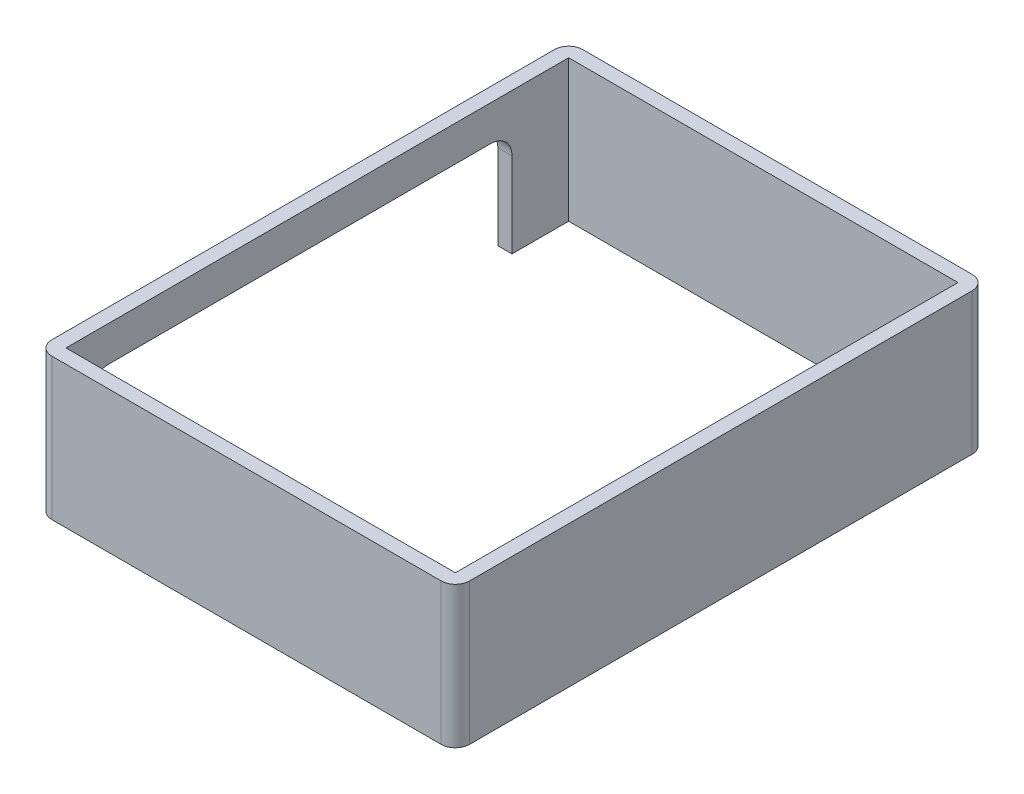
ISO-10303-21;
HEADER;
FILE_DESCRIPTION(('STEP AP214'),'2;1');
FILE_NAME('part.step','',(''),(''),'','','');
FILE_SCHEMA(('AUTOMOTIVE_DESIGN { 1 0 10303 214 1 1 1 1 }'));
ENDSEC;
DATA;
#1=APPLICATION_CONTEXT('core data for automotive mechanical design processes');
#2=APPLICATION_PROTOCOL_DEFINITION('international standard','automotive_design',2000,#1);
#3=PRODUCT_CONTEXT('',#1,'mechanical');
#4=PRODUCT('Part','Part','',(#3));
#5=PRODUCT_RELATED_PRODUCT_CATEGORY('part','',(#4));
#6=PRODUCT_DEFINITION_FORMATION('','',#4);
#7=PRODUCT_DEFINITION_CONTEXT('part definition',#1,'design');
#8=PRODUCT_DEFINITION('design','',#6,#7);
#9=PRODUCT_DEFINITION_SHAPE('','',#8);
#10=(LENGTH_UNIT() NAMED_UNIT(*) SI_UNIT(.MILLI.,.METRE.));
#11=(NAMED_UNIT(*) PLANE_ANGLE_UNIT() SI_UNIT($,.RADIAN.));
#12=(NAMED_UNIT(*) SI_UNIT($,.STERADIAN.) SOLID_ANGLE_UNIT());
#13=UNCERTAINTY_MEASURE_WITH_UNIT(LENGTH_MEASURE(1.E-05),#10,'distance_accuracy_value','');
#14=(GEOMETRIC_REPRESENTATION_CONTEXT(3) GLOBAL_UNCERTAINTY_ASSIGNED_CONTEXT((#13)) GLOBAL_UNIT_ASSIGNED_CONTEXT((#10,
#11,#12)) REPRESENTATION_CONTEXT('',''));
#15=CARTESIAN_POINT('',(0.,0.,0.));
#16=DIRECTION('',(0.,0.,1.));
#17=DIRECTION('',(1.,0.,0.));
#18=AXIS2_PLACEMENT_3D('',#15,#16,#17);
#19=CARTESIAN_POINT('',(27.5,20.,35.5));
#20=DIRECTION('',(0.,1.,0.));
#21=DIRECTION('',(0.,0.,1.));
#22=AXIS2_PLACEMENT_3D('',#19,#20,#21);
#23=PLANE('',#22);
#24=CARTESIAN_POINT('',(27.5,20.,35.5));
#25=DIRECTION('',(0.,1.,0.));
#26=DIRECTION('',(0.,0.,1.));
#27=AXIS2_PLACEMENT_3D('',#24,#25,#26);
#28=CIRCLE('',#27,2.);
#29=CARTESIAN_POINT('',(27.5,20.,37.5));
#30=VERTEX_POINT('',#29);
#31=CARTESIAN_POINT('',(29.5,20.,35.5));
#32=VERTEX_POINT('',#31);
#33=EDGE_CURVE('E256',#30,#32,#28,.T.);
#34=ORIENTED_EDGE('',*,*,#33,.T.);
#35=DIRECTION('',(0.,0.,-1.));
#36=VECTOR('',#35,1.);
#37=CARTESIAN_POINT('',(29.5,20.,35.5));
#38=LINE('',#37,#36);
#39=CARTESIAN_POINT('',(29.5,20.,-35.5));
#40=VERTEX_POINT('',#39);
#41=EDGE_CURVE('E260',#32,#40,#38,.T.);
#42=ORIENTED_EDGE('',*,*,#41,.T.);
#43=CARTESIAN_POINT('',(27.5,20.,-35.5));
#44=DIRECTION('',(0.,1.,0.));
#45=DIRECTION('',(0.,0.,1.));
#46=AXIS2_PLACEMENT_3D('',#43,#44,#45);
#47=CIRCLE('',#46,2.);
#48=CARTESIAN_POINT('',(27.5,20.,-37.5));
#49=VERTEX_POINT('',#48);
#50=EDGE_CURVE('E264',#40,#49,#47,.T.);
#51=ORIENTED_EDGE('',*,*,#50,.T.);
#52=DIRECTION('',(-1.,0.,0.));
#53=VECTOR('',#52,1.);
#54=CARTESIAN_POINT('',(27.5,20.,-37.5));
#55=LINE('',#54,#53);
#56=CARTESIAN_POINT('',(-27.5,20.,-37.5));
#57=VERTEX_POINT('',#56);
#58=EDGE_CURVE('E267',#49,#57,#55,.T.);
#59=ORIENTED_EDGE('',*,*,#58,.T.);
#60=CARTESIAN_POINT('',(-27.5,20.,-35.5));
#61=DIRECTION('',(0.,1.,0.));
#62=DIRECTION('',(0.,0.,1.));
#63=AXIS2_PLACEMENT_3D('',#60,#61,#62);
#64=CIRCLE('',#63,2.);
#65=CARTESIAN_POINT('',(-29.5,20.,-35.5));
#66=VERTEX_POINT('',#65);
#67=EDGE_CURVE('E270',#57,#66,#64,.T.);
#68=ORIENTED_EDGE('',*,*,#67,.T.);
#69=DIRECTION('',(0.,0.,1.));
#70=VECTOR('',#69,1.);
#71=CARTESIAN_POINT('',(-29.5,20.,-35.5));
#72=LINE('',#71,#70);
#73=CARTESIAN_POINT('',(-29.5,20.,35.5));
#74=VERTEX_POINT('',#73);
#75=EDGE_CURVE('E273',#66,#74,#72,.T.);
#76=ORIENTED_EDGE('',*,*,#75,.T.);
#77=CARTESIAN_POINT('',(-27.5,20.,35.5));
#78=DIRECTION('',(0.,1.,0.));
#79=DIRECTION('',(0.,0.,1.));
#80=AXIS2_PLACEMENT_3D('',#77,#78,#79);
#81=CIRCLE('',#80,2.);
#82=CARTESIAN_POINT('',(-27.5,20.,37.5));
#83=VERTEX_POINT('',#82);
#84=EDGE_CURVE('E276',#74,#83,#81,.T.);
#85=ORIENTED_EDGE('',*,*,#84,.T.);
#86=DIRECTION('',(1.,0.,0.));
#87=VECTOR('',#86,1.);
#88=CARTESIAN_POINT('',(-27.5,20.,37.5));
#89=LINE('',#88,#87);
#90=EDGE_CURVE('E279',#83,#30,#89,.T.);
#91=ORIENTED_EDGE('',*,*,#90,.T.);
#92=EDGE_LOOP('',(#34,#42,#51,#59,#68,#76,#85,#91));
#93=FACE_BOUND('',#92,.T.);
#94=DIRECTION('',(0.,0.,-1.));
#95=VECTOR('',#94,1.);
#96=CARTESIAN_POINT('',(27.5,20.,35.5));
#97=LINE('',#96,#95);
#98=CARTESIAN_POINT('',(27.5,20.,35.5));
#99=VERTEX_POINT('',#98);
#100=CARTESIAN_POINT('',(27.5,20.,-35.5));
#101=VERTEX_POINT('',#100);
#102=EDGE_CURVE('E217',#99,#101,#97,.T.);
#103=ORIENTED_EDGE('',*,*,#102,.F.);
#104=DIRECTION('',(1.,0.,0.));
#105=VECTOR('',#104,1.);
#106=CARTESIAN_POINT('',(-27.5,20.,35.5));
#107=LINE('',#106,#105);
#108=CARTESIAN_POINT('',(-27.5,20.,35.5));
#109=VERTEX_POINT('',#108);
#110=EDGE_CURVE('E214',#109,#99,#107,.T.);
#111=ORIENTED_EDGE('',*,*,#110,.F.);
#112=DIRECTION('',(0.,0.,1.));
#113=VECTOR('',#112,1.);
#114=CARTESIAN_POINT('',(-27.5,20.,-35.5));
#115=LINE('',#114,#113);
#116=CARTESIAN_POINT('',(-27.5,20.,-35.5));
#117=VERTEX_POINT('',#116);
#118=EDGE_CURVE('E224',#117,#109,#115,.T.);
#119=ORIENTED_EDGE('',*,*,#118,.F.);
#120=DIRECTION('',(-1.,0.,0.));
#121=VECTOR('',#120,1.);
#122=CARTESIAN_POINT('',(27.5,20.,-35.5));
#123=LINE('',#122,#121);
#124=EDGE_CURVE('E221',#101,#117,#123,.T.);
#125=ORIENTED_EDGE('',*,*,#124,.F.);
#126=EDGE_LOOP('',(#103,#111,#119,#125));
#127=FACE_BOUND('',#126,.T.);
#128=ADVANCED_FACE('F39',(#93,#127),#23,.T.);
#129=CARTESIAN_POINT('',(27.5,0.,35.5));
#130=DIRECTION('',(0.,1.,0.));
#131=DIRECTION('',(0.,0.,1.));
#132=AXIS2_PLACEMENT_3D('',#129,#130,#131);
#133=PLANE('',#132);
#134=DIRECTION('',(0.,0.,1.));
#135=VECTOR('',#134,1.);
#136=CARTESIAN_POINT('',(-29.5,0.,-35.5));
#137=LINE('',#136,#135);
#138=CARTESIAN_POINT('',(-29.5,0.,32.5));
#139=VERTEX_POINT('',#138);
#140=CARTESIAN_POINT('',(-29.5,0.,35.5));
#141=VERTEX_POINT('',#140);
#142=EDGE_CURVE('E298',#139,#141,#137,.T.);
#143=ORIENTED_EDGE('',*,*,#142,.F.);
#144=DIRECTION('',(1.,0.,0.));
#145=VECTOR('',#144,1.);
#146=CARTESIAN_POINT('',(27.5,0.,32.5));
#147=LINE('',#146,#145);
#148=CARTESIAN_POINT('',(-27.5,0.,32.5));
#149=VERTEX_POINT('',#148);
#150=EDGE_CURVE('E170',#139,#149,#147,.T.);
#151=ORIENTED_EDGE('',*,*,#150,.T.);
#152=DIRECTION('',(0.,0.,1.));
#153=VECTOR('',#152,1.);
#154=CARTESIAN_POINT('',(-27.5,0.,-35.5));
#155=LINE('',#154,#153);
#156=CARTESIAN_POINT('',(-27.5,0.,35.5));
#157=VERTEX_POINT('',#156);
#158=EDGE_CURVE('E239',#149,#157,#155,.T.);
#159=ORIENTED_EDGE('',*,*,#158,.T.);
#160=DIRECTION('',(1.,0.,0.));
#161=VECTOR('',#160,1.);
#162=CARTESIAN_POINT('',(-27.5,0.,35.5));
#163=LINE('',#162,#161);
#164=CARTESIAN_POINT('',(27.5,0.,35.5));
#165=VERTEX_POINT('',#164);
#166=EDGE_CURVE('E213',#157,#165,#163,.T.);
#167=ORIENTED_EDGE('',*,*,#166,.T.);
#168=DIRECTION('',(0.,0.,-1.));
#169=VECTOR('',#168,1.);
#170=CARTESIAN_POINT('',(27.5,0.,35.5));
#171=LINE('',#170,#169);
#172=CARTESIAN_POINT('',(27.5,0.,-35.5));
#173=VERTEX_POINT('',#172);
#174=EDGE_CURVE('E231',#165,#173,#171,.T.);
#175=ORIENTED_EDGE('',*,*,#174,.T.);
#176=DIRECTION('',(-1.,0.,0.));
#177=VECTOR('',#176,1.);
#178=CARTESIAN_POINT('',(27.5,0.,-35.5));
#179=LINE('',#178,#177);
#180=CARTESIAN_POINT('',(-27.5,0.,-35.5));
#181=VERTEX_POINT('',#180);
#182=EDGE_CURVE('E235',#173,#181,#179,.T.);
#183=ORIENTED_EDGE('',*,*,#182,.T.);
#184=CARTESIAN_POINT('',(-27.5,0.,-27.5));
#185=VERTEX_POINT('',#184);
#186=EDGE_CURVE('E218',#181,#185,#155,.T.);
#187=ORIENTED_EDGE('',*,*,#186,.T.);
#188=DIRECTION('',(-1.,0.,0.));
#189=VECTOR('',#188,1.);
#190=CARTESIAN_POINT('',(27.5,0.,-27.5));
#191=LINE('',#190,#189);
#192=CARTESIAN_POINT('',(-29.5,0.,-27.5));
#193=VERTEX_POINT('',#192);
#194=EDGE_CURVE('E202',#185,#193,#191,.T.);
#195=ORIENTED_EDGE('',*,*,#194,.T.);
#196=CARTESIAN_POINT('',(-29.5,0.,-35.5));
#197=VERTEX_POINT('',#196);
#198=EDGE_CURVE('E299',#197,#193,#137,.T.);
#199=ORIENTED_EDGE('',*,*,#198,.F.);
#200=CARTESIAN_POINT('',(-27.5,0.,-35.5));
#201=DIRECTION('',(0.,1.,0.));
#202=DIRECTION('',(0.,0.,1.));
#203=AXIS2_PLACEMENT_3D('',#200,#201,#202);
#204=CIRCLE('',#203,2.);
#205=CARTESIAN_POINT('',(-27.5,0.,-37.5));
#206=VERTEX_POINT('',#205);
#207=EDGE_CURVE('E295',#206,#197,#204,.T.);
#208=ORIENTED_EDGE('',*,*,#207,.F.);
#209=DIRECTION('',(-1.,0.,0.));
#210=VECTOR('',#209,1.);
#211=CARTESIAN_POINT('',(27.5,0.,-37.5));
#212=LINE('',#211,#210);
#213=CARTESIAN_POINT('',(27.5,0.,-37.5));
#214=VERTEX_POINT('',#213);
#215=EDGE_CURVE('E292',#214,#206,#212,.T.);
#216=ORIENTED_EDGE('',*,*,#215,.F.);
#217=CARTESIAN_POINT('',(27.5,0.,-35.5));
#218=DIRECTION('',(0.,1.,0.));
#219=DIRECTION('',(0.,0.,1.));
#220=AXIS2_PLACEMENT_3D('',#217,#218,#219);
#221=CIRCLE('',#220,2.);
#222=CARTESIAN_POINT('',(29.5,0.,-35.5));
#223=VERTEX_POINT('',#222);
#224=EDGE_CURVE('E289',#223,#214,#221,.T.);
#225=ORIENTED_EDGE('',*,*,#224,.F.);
#226=DIRECTION('',(0.,0.,-1.));
#227=VECTOR('',#226,1.);
#228=CARTESIAN_POINT('',(29.5,0.,35.5));
#229=LINE('',#228,#227);
#230=CARTESIAN_POINT('',(29.5,0.,35.5));
#231=VERTEX_POINT('',#230);
#232=EDGE_CURVE('E286',#231,#223,#229,.T.);
#233=ORIENTED_EDGE('',*,*,#232,.F.);
#234=CARTESIAN_POINT('',(27.5,0.,35.5));
#235=DIRECTION('',(0.,1.,0.));
#236=DIRECTION('',(0.,0.,1.));
#237=AXIS2_PLACEMENT_3D('',#234,#235,#236);
#238=CIRCLE('',#237,2.);
#239=CARTESIAN_POINT('',(27.5,0.,37.5));
#240=VERTEX_POINT('',#239);
#241=EDGE_CURVE('E255',#240,#231,#238,.T.);
#242=ORIENTED_EDGE('',*,*,#241,.F.);
#243=DIRECTION('',(1.,0.,0.));
#244=VECTOR('',#243,1.);
#245=CARTESIAN_POINT('',(-27.5,0.,37.5));
#246=LINE('',#245,#244);
#247=CARTESIAN_POINT('',(-27.5,0.,37.5));
#248=VERTEX_POINT('',#247);
#249=EDGE_CURVE('E261',#248,#240,#246,.T.);
#250=ORIENTED_EDGE('',*,*,#249,.F.);
#251=CARTESIAN_POINT('',(-27.5,0.,35.5));
#252=DIRECTION('',(0.,1.,0.));
#253=DIRECTION('',(0.,0.,1.));
#254=AXIS2_PLACEMENT_3D('',#251,#252,#253);
#255=CIRCLE('',#254,2.);
#256=EDGE_CURVE('E303',#141,#248,#255,.T.);
#257=ORIENTED_EDGE('',*,*,#256,.F.);
#258=EDGE_LOOP('',(#143,#151,#159,#167,#175,#183,#187,#195,#199,#208,#216,#225,#233,#242,#250,#257));
#259=FACE_BOUND('',#258,.T.);
#260=ADVANCED_FACE('F362',(#259),#133,.F.);
#261=CARTESIAN_POINT('',(27.5,20.,35.5));
#262=DIRECTION('',(0.,-1.,0.));
#263=DIRECTION('',(0.,0.,-1.));
#264=AXIS2_PLACEMENT_3D('',#261,#262,#263);
#265=CYLINDRICAL_SURFACE('',#264,2.);
#266=ORIENTED_EDGE('',*,*,#241,.T.);
#267=DIRECTION('',(0.,-1.,0.));
#268=VECTOR('',#267,1.);
#269=CARTESIAN_POINT('',(29.5,20.,35.5));
#270=LINE('',#269,#268);
#271=EDGE_CURVE('E335',#32,#231,#270,.T.);
#272=ORIENTED_EDGE('',*,*,#271,.F.);
#273=ORIENTED_EDGE('',*,*,#33,.F.);
#274=DIRECTION('',(0.,-1.,0.));
#275=VECTOR('',#274,1.);
#276=CARTESIAN_POINT('',(27.5,20.,37.5));
#277=LINE('',#276,#275);
#278=EDGE_CURVE('E282',#30,#240,#277,.T.);
#279=ORIENTED_EDGE('',*,*,#278,.T.);
#280=EDGE_LOOP('',(#266,#272,#273,#279));
#281=FACE_BOUND('',#280,.T.);
#282=ADVANCED_FACE('F41',(#281),#265,.T.);
#283=CARTESIAN_POINT('',(29.5,20.,35.5));
#284=DIRECTION('',(-1.,0.,0.));
#285=DIRECTION('',(0.,0.,1.));
#286=AXIS2_PLACEMENT_3D('',#283,#284,#285);
#287=PLANE('',#286);
#288=ORIENTED_EDGE('',*,*,#232,.T.);
#289=DIRECTION('',(0.,-1.,0.));
#290=VECTOR('',#289,1.);
#291=CARTESIAN_POINT('',(29.5,20.,-35.5));
#292=LINE('',#291,#290);
#293=EDGE_CURVE('E331',#40,#223,#292,.T.);
#294=ORIENTED_EDGE('',*,*,#293,.F.);
#295=ORIENTED_EDGE('',*,*,#41,.F.);
#296=ORIENTED_EDGE('',*,*,#271,.T.);
#297=EDGE_LOOP('',(#288,#294,#295,#296));
#298=FACE_BOUND('',#297,.T.);
#299=ADVANCED_FACE('F414',(#298),#287,.F.);
#300=CARTESIAN_POINT('',(27.5,20.,-35.5));
#301=DIRECTION('',(0.,-1.,0.));
#302=DIRECTION('',(0.,0.,-1.));
#303=AXIS2_PLACEMENT_3D('',#300,#301,#302);
#304=CYLINDRICAL_SURFACE('',#303,2.);
#305=ORIENTED_EDGE('',*,*,#224,.T.);
#306=DIRECTION('',(0.,-1.,0.));
#307=VECTOR('',#306,1.);
#308=CARTESIAN_POINT('',(27.5,20.,-37.5));
#309=LINE('',#308,#307);
#310=EDGE_CURVE('E327',#49,#214,#309,.T.);
#311=ORIENTED_EDGE('',*,*,#310,.F.);
#312=ORIENTED_EDGE('',*,*,#50,.F.);
#313=ORIENTED_EDGE('',*,*,#293,.T.);
#314=EDGE_LOOP('',(#305,#311,#312,#313));
#315=FACE_BOUND('',#314,.T.);
#316=ADVANCED_FACE('F412',(#315),#304,.T.);
#317=CARTESIAN_POINT('',(27.5,20.,-37.5));
#318=DIRECTION('',(0.,0.,1.));
#319=DIRECTION('',(1.,0.,0.));
#320=AXIS2_PLACEMENT_3D('',#317,#318,#319);
#321=PLANE('',#320);
#322=ORIENTED_EDGE('',*,*,#215,.T.);
#323=DIRECTION('',(0.,-1.,0.));
#324=VECTOR('',#323,1.);
#325=CARTESIAN_POINT('',(-27.5,20.,-37.5));
#326=LINE('',#325,#324);
#327=EDGE_CURVE('E323',#57,#206,#326,.T.);
#328=ORIENTED_EDGE('',*,*,#327,.F.);
#329=ORIENTED_EDGE('',*,*,#58,.F.);
#330=ORIENTED_EDGE('',*,*,#310,.T.);
#331=EDGE_LOOP('',(#322,#328,#329,#330));
#332=FACE_BOUND('',#331,.T.);
#333=ADVANCED_FACE('F407',(#332),#321,.F.);
#334=CARTESIAN_POINT('',(-27.5,20.,-35.5));
#335=DIRECTION('',(0.,-1.,0.));
#336=DIRECTION('',(0.,0.,-1.));
#337=AXIS2_PLACEMENT_3D('',#334,#335,#336);
#338=CYLINDRICAL_SURFACE('',#337,2.);
#339=ORIENTED_EDGE('',*,*,#207,.T.);
#340=DIRECTION('',(0.,-1.,0.));
#341=VECTOR('',#340,1.);
#342=CARTESIAN_POINT('',(-29.5,20.,-35.5));
#343=LINE('',#342,#341);
#344=EDGE_CURVE('E319',#66,#197,#343,.T.);
#345=ORIENTED_EDGE('',*,*,#344,.F.);
#346=ORIENTED_EDGE('',*,*,#67,.F.);
#347=ORIENTED_EDGE('',*,*,#327,.T.);
#348=EDGE_LOOP('',(#339,#345,#346,#347));
#349=FACE_BOUND('',#348,.T.);
#350=ADVANCED_FACE('F402',(#349),#338,.T.);
#351=CARTESIAN_POINT('',(-29.5,20.,-35.5));
#352=DIRECTION('',(1.,0.,0.));
#353=DIRECTION('',(0.,0.,-1.));
#354=AXIS2_PLACEMENT_3D('',#351,#352,#353);
#355=PLANE('',#354);
#356=CARTESIAN_POINT('',(-29.5,12.,29.5));
#357=DIRECTION('',(-1.,0.,0.));
#358=DIRECTION('',(0.,0.,-1.));
#359=AXIS2_PLACEMENT_3D('',#356,#357,#358);
#360=CIRCLE('',#359,3.);
#361=CARTESIAN_POINT('',(-29.5,12.,32.5));
#362=VERTEX_POINT('',#361);
#363=CARTESIAN_POINT('',(-29.5,15.,29.5));
#364=VERTEX_POINT('',#363);
#365=EDGE_CURVE('E175',#362,#364,#360,.T.);
#366=ORIENTED_EDGE('',*,*,#365,.F.);
#367=DIRECTION('',(0.,1.,0.));
#368=VECTOR('',#367,1.);
#369=CARTESIAN_POINT('',(-29.5,12.,32.5));
#370=LINE('',#369,#368);
#371=EDGE_CURVE('E164',#139,#362,#370,.T.);
#372=ORIENTED_EDGE('',*,*,#371,.F.);
#373=ORIENTED_EDGE('',*,*,#142,.T.);
#374=DIRECTION('',(0.,-1.,0.));
#375=VECTOR('',#374,1.);
#376=CARTESIAN_POINT('',(-29.5,20.,35.5));
#377=LINE('',#376,#375);
#378=EDGE_CURVE('E315',#74,#141,#377,.T.);
#379=ORIENTED_EDGE('',*,*,#378,.F.);
#380=ORIENTED_EDGE('',*,*,#75,.F.);
#381=ORIENTED_EDGE('',*,*,#344,.T.);
#382=ORIENTED_EDGE('',*,*,#198,.T.);
#383=DIRECTION('',(0.,-1.,0.));
#384=VECTOR('',#383,1.);
#385=CARTESIAN_POINT('',(-29.5,12.,-27.5));
#386=LINE('',#385,#384);
#387=CARTESIAN_POINT('',(-29.5,12.,-27.5));
#388=VERTEX_POINT('',#387);
#389=EDGE_CURVE('E182',#388,#193,#386,.T.);
#390=ORIENTED_EDGE('',*,*,#389,.F.);
#391=CARTESIAN_POINT('',(-29.5,12.,-24.5));
#392=DIRECTION('',(-1.,0.,0.));
#393=DIRECTION('',(0.,0.,1.));
#394=AXIS2_PLACEMENT_3D('',#391,#392,#393);
#395=CIRCLE('',#394,3.);
#396=CARTESIAN_POINT('',(-29.5,15.,-24.5));
#397=VERTEX_POINT('',#396);
#398=EDGE_CURVE('E191',#397,#388,#395,.T.);
#399=ORIENTED_EDGE('',*,*,#398,.F.);
#400=DIRECTION('',(0.,0.,-1.));
#401=VECTOR('',#400,1.);
#402=CARTESIAN_POINT('',(-29.5,15.,-24.5));
#403=LINE('',#402,#401);
#404=EDGE_CURVE('E187',#364,#397,#403,.T.);
#405=ORIENTED_EDGE('',*,*,#404,.F.);
#406=EDGE_LOOP('',(#366,#372,#373,#379,#380,#381,#382,#390,#399,#405));
#407=FACE_BOUND('',#406,.T.);
#408=ADVANCED_FACE('F184',(#407),#355,.F.);
#409=CARTESIAN_POINT('',(-27.5,20.,35.5));
#410=DIRECTION('',(0.,-1.,0.));
#411=DIRECTION('',(0.,0.,-1.));
#412=AXIS2_PLACEMENT_3D('',#409,#410,#411);
#413=CYLINDRICAL_SURFACE('',#412,2.);
#414=ORIENTED_EDGE('',*,*,#256,.T.);
#415=DIRECTION('',(0.,-1.,0.));
#416=VECTOR('',#415,1.);
#417=CARTESIAN_POINT('',(-27.5,20.,37.5));
#418=LINE('',#417,#416);
#419=EDGE_CURVE('E311',#83,#248,#418,.T.);
#420=ORIENTED_EDGE('',*,*,#419,.F.);
#421=ORIENTED_EDGE('',*,*,#84,.F.);
#422=ORIENTED_EDGE('',*,*,#378,.T.);
#423=EDGE_LOOP('',(#414,#420,#421,#422));
#424=FACE_BOUND('',#423,.T.);
#425=ADVANCED_FACE('F386',(#424),#413,.T.);
#426=CARTESIAN_POINT('',(-27.5,20.,37.5));
#427=DIRECTION('',(0.,0.,-1.));
#428=DIRECTION('',(-1.,0.,0.));
#429=AXIS2_PLACEMENT_3D('',#426,#427,#428);
#430=PLANE('',#429);
#431=ORIENTED_EDGE('',*,*,#249,.T.);
#432=ORIENTED_EDGE('',*,*,#278,.F.);
#433=ORIENTED_EDGE('',*,*,#90,.F.);
#434=ORIENTED_EDGE('',*,*,#419,.T.);
#435=EDGE_LOOP('',(#431,#432,#433,#434));
#436=FACE_BOUND('',#435,.T.);
#437=ADVANCED_FACE('F392',(#436),#430,.F.);
#438=CARTESIAN_POINT('',(-27.5,20.,35.5));
#439=DIRECTION('',(0.,0.,-1.));
#440=DIRECTION('',(-1.,0.,0.));
#441=AXIS2_PLACEMENT_3D('',#438,#439,#440);
#442=PLANE('',#441);
#443=ORIENTED_EDGE('',*,*,#166,.F.);
#444=DIRECTION('',(0.,-1.,0.));
#445=VECTOR('',#444,1.);
#446=CARTESIAN_POINT('',(-27.5,20.,35.5));
#447=LINE('',#446,#445);
#448=EDGE_CURVE('E227',#109,#157,#447,.T.);
#449=ORIENTED_EDGE('',*,*,#448,.F.);
#450=ORIENTED_EDGE('',*,*,#110,.T.);
#451=DIRECTION('',(0.,-1.,0.));
#452=VECTOR('',#451,1.);
#453=CARTESIAN_POINT('',(27.5,20.,35.5));
#454=LINE('',#453,#452);
#455=EDGE_CURVE('E251',#99,#165,#454,.T.);
#456=ORIENTED_EDGE('',*,*,#455,.T.);
#457=EDGE_LOOP('',(#443,#449,#450,#456));
#458=FACE_BOUND('',#457,.T.);
#459=ADVANCED_FACE('F377',(#458),#442,.T.);
#460=CARTESIAN_POINT('',(27.5,20.,35.5));
#461=DIRECTION('',(-1.,0.,0.));
#462=DIRECTION('',(0.,0.,1.));
#463=AXIS2_PLACEMENT_3D('',#460,#461,#462);
#464=PLANE('',#463);
#465=ORIENTED_EDGE('',*,*,#174,.F.);
#466=ORIENTED_EDGE('',*,*,#455,.F.);
#467=ORIENTED_EDGE('',*,*,#102,.T.);
#468=DIRECTION('',(0.,-1.,0.));
#469=VECTOR('',#468,1.);
#470=CARTESIAN_POINT('',(27.5,20.,-35.5));
#471=LINE('',#470,#469);
#472=EDGE_CURVE('E248',#101,#173,#471,.T.);
#473=ORIENTED_EDGE('',*,*,#472,.T.);
#474=EDGE_LOOP('',(#465,#466,#467,#473));
#475=FACE_BOUND('',#474,.T.);
#476=ADVANCED_FACE('F467',(#475),#464,.T.);
#477=CARTESIAN_POINT('',(27.5,20.,-35.5));
#478=DIRECTION('',(0.,0.,1.));
#479=DIRECTION('',(1.,0.,0.));
#480=AXIS2_PLACEMENT_3D('',#477,#478,#479);
#481=PLANE('',#480);
#482=ORIENTED_EDGE('',*,*,#182,.F.);
#483=ORIENTED_EDGE('',*,*,#472,.F.);
#484=ORIENTED_EDGE('',*,*,#124,.T.);
#485=DIRECTION('',(0.,-1.,0.));
#486=VECTOR('',#485,1.);
#487=CARTESIAN_POINT('',(-27.5,20.,-35.5));
#488=LINE('',#487,#486);
#489=EDGE_CURVE('E63',#117,#181,#488,.T.);
#490=ORIENTED_EDGE('',*,*,#489,.T.);
#491=EDGE_LOOP('',(#482,#483,#484,#490));
#492=FACE_BOUND('',#491,.T.);
#493=ADVANCED_FACE('F367',(#492),#481,.T.);
#494=CARTESIAN_POINT('',(-27.5,20.,-35.5));
#495=DIRECTION('',(1.,0.,0.));
#496=DIRECTION('',(0.,0.,-1.));
#497=AXIS2_PLACEMENT_3D('',#494,#495,#496);
#498=PLANE('',#497);
#499=DIRECTION('',(0.,-1.,0.));
#500=VECTOR('',#499,1.);
#501=CARTESIAN_POINT('',(-27.5,20.,32.5));
#502=LINE('',#501,#500);
#503=CARTESIAN_POINT('',(-27.5,12.,32.5));
#504=VERTEX_POINT('',#503);
#505=EDGE_CURVE('E11',#504,#149,#502,.T.);
#506=ORIENTED_EDGE('',*,*,#505,.F.);
#507=CARTESIAN_POINT('',(-27.5,12.,29.5));
#508=DIRECTION('',(1.,0.,0.));
#509=DIRECTION('',(0.,0.,-1.));
#510=AXIS2_PLACEMENT_3D('',#507,#508,#509);
#511=CIRCLE('',#510,3.);
#512=CARTESIAN_POINT('',(-27.5,15.,29.5));
#513=VERTEX_POINT('',#512);
#514=EDGE_CURVE('E180',#513,#504,#511,.T.);
#515=ORIENTED_EDGE('',*,*,#514,.F.);
#516=DIRECTION('',(0.,0.,1.));
#517=VECTOR('',#516,1.);
#518=CARTESIAN_POINT('',(-27.5,15.,-35.5));
#519=LINE('',#518,#517);
#520=CARTESIAN_POINT('',(-27.5,15.,-24.5));
#521=VERTEX_POINT('',#520);
#522=EDGE_CURVE('E341',#521,#513,#519,.T.);
#523=ORIENTED_EDGE('',*,*,#522,.F.);
#524=CARTESIAN_POINT('',(-27.5,12.,-24.5));
#525=DIRECTION('',(1.,0.,0.));
#526=DIRECTION('',(0.,0.,-1.));
#527=AXIS2_PLACEMENT_3D('',#524,#525,#526);
#528=CIRCLE('',#527,3.);
#529=CARTESIAN_POINT('',(-27.5,12.,-27.5));
#530=VERTEX_POINT('',#529);
#531=EDGE_CURVE('E344',#530,#521,#528,.T.);
#532=ORIENTED_EDGE('',*,*,#531,.F.);
#533=DIRECTION('',(0.,1.,0.));
#534=VECTOR('',#533,1.);
#535=CARTESIAN_POINT('',(-27.5,20.,-27.5));
#536=LINE('',#535,#534);
#537=EDGE_CURVE('E48',#185,#530,#536,.T.);
#538=ORIENTED_EDGE('',*,*,#537,.F.);
#539=ORIENTED_EDGE('',*,*,#186,.F.);
#540=ORIENTED_EDGE('',*,*,#489,.F.);
#541=ORIENTED_EDGE('',*,*,#118,.T.);
#542=ORIENTED_EDGE('',*,*,#448,.T.);
#543=ORIENTED_EDGE('',*,*,#158,.F.);
#544=EDGE_LOOP('',(#506,#515,#523,#532,#538,#539,#540,#541,#542,#543));
#545=FACE_BOUND('',#544,.T.);
#546=ADVANCED_FACE('F357',(#545),#498,.T.);
#547=CARTESIAN_POINT('',(-9.5,12.,32.5));
#548=DIRECTION('',(0.,0.,1.));
#549=DIRECTION('',(1.,0.,0.));
#550=AXIS2_PLACEMENT_3D('',#547,#548,#549);
#551=PLANE('',#550);
#552=ORIENTED_EDGE('',*,*,#371,.T.);
#553=DIRECTION('',(-1.,0.,0.));
#554=VECTOR('',#553,1.);
#555=CARTESIAN_POINT('',(-9.5,12.,32.5));
#556=LINE('',#555,#554);
#557=EDGE_CURVE('E167',#504,#362,#556,.T.);
#558=ORIENTED_EDGE('',*,*,#557,.F.);
#559=ORIENTED_EDGE('',*,*,#505,.T.);
#560=ORIENTED_EDGE('',*,*,#150,.F.);
#561=EDGE_LOOP('',(#552,#558,#559,#560));
#562=FACE_BOUND('',#561,.T.);
#563=ADVANCED_FACE('F166',(#562),#551,.F.);
#564=CARTESIAN_POINT('',(-9.5,12.,-27.5));
#565=DIRECTION('',(0.,0.,-1.));
#566=DIRECTION('',(0.,1.,0.));
#567=AXIS2_PLACEMENT_3D('',#564,#565,#566);
#568=PLANE('',#567);
#569=ORIENTED_EDGE('',*,*,#537,.T.);
#570=DIRECTION('',(-1.,0.,0.));
#571=VECTOR('',#570,1.);
#572=CARTESIAN_POINT('',(-9.5,12.,-27.5));
#573=LINE('',#572,#571);
#574=EDGE_CURVE('E199',#530,#388,#573,.T.);
#575=ORIENTED_EDGE('',*,*,#574,.T.);
#576=ORIENTED_EDGE('',*,*,#389,.T.);
#577=ORIENTED_EDGE('',*,*,#194,.F.);
#578=EDGE_LOOP('',(#569,#575,#576,#577));
#579=FACE_BOUND('',#578,.T.);
#580=ADVANCED_FACE('F350',(#579),#568,.F.);
#581=CARTESIAN_POINT('',(-9.5,12.,-24.5));
#582=DIRECTION('',(-1.,0.,0.));
#583=DIRECTION('',(0.,0.,1.));
#584=AXIS2_PLACEMENT_3D('',#581,#582,#583);
#585=CYLINDRICAL_SURFACE('',#584,3.);
#586=ORIENTED_EDGE('',*,*,#531,.T.);
#587=DIRECTION('',(-1.,0.,0.));
#588=VECTOR('',#587,1.);
#589=CARTESIAN_POINT('',(-9.5,15.,-24.5));
#590=LINE('',#589,#588);
#591=EDGE_CURVE('E203',#521,#397,#590,.T.);
#592=ORIENTED_EDGE('',*,*,#591,.T.);
#593=ORIENTED_EDGE('',*,*,#398,.T.);
#594=ORIENTED_EDGE('',*,*,#574,.F.);
#595=EDGE_LOOP('',(#586,#592,#593,#594));
#596=FACE_BOUND('',#595,.T.);
#597=ADVANCED_FACE('F353',(#596),#585,.F.);
#598=CARTESIAN_POINT('',(-9.5,15.,-24.5));
#599=DIRECTION('',(0.,1.,0.));
#600=DIRECTION('',(0.,0.,1.));
#601=AXIS2_PLACEMENT_3D('',#598,#599,#600);
#602=PLANE('',#601);
#603=ORIENTED_EDGE('',*,*,#522,.T.);
#604=DIRECTION('',(-1.,0.,0.));
#605=VECTOR('',#604,1.);
#606=CARTESIAN_POINT('',(-9.5,15.,29.5));
#607=LINE('',#606,#605);
#608=EDGE_CURVE('E55',#513,#364,#607,.T.);
#609=ORIENTED_EDGE('',*,*,#608,.T.);
#610=ORIENTED_EDGE('',*,*,#404,.T.);
#611=ORIENTED_EDGE('',*,*,#591,.F.);
#612=EDGE_LOOP('',(#603,#609,#610,#611));
#613=FACE_BOUND('',#612,.T.);
#614=ADVANCED_FACE('F359',(#613),#602,.F.);
#615=CARTESIAN_POINT('',(-9.5,12.,29.5));
#616=DIRECTION('',(-1.,0.,0.));
#617=DIRECTION('',(0.,0.,1.));
#618=AXIS2_PLACEMENT_3D('',#615,#616,#617);
#619=CYLINDRICAL_SURFACE('',#618,3.);
#620=ORIENTED_EDGE('',*,*,#514,.T.);
#621=ORIENTED_EDGE('',*,*,#557,.T.);
#622=ORIENTED_EDGE('',*,*,#365,.T.);
#623=ORIENTED_EDGE('',*,*,#608,.F.);
#624=EDGE_LOOP('',(#620,#621,#622,#623));
#625=FACE_BOUND('',#624,.T.);
#626=ADVANCED_FACE('F177',(#625),#619,.F.);
#627=CLOSED_SHELL('',(#128,#260,#282,#299,#316,#333,#350,#408,#425,#437,#459,#476,#493,#546,
#563,#580,#597,#614,#626));
#628=MANIFOLD_SOLID_BREP('B2',#627);
#629=ADVANCED_BREP_SHAPE_REPRESENTATION('',(#18,#628),#14);
#630=SHAPE_DEFINITION_REPRESENTATION(#9,#629);
ENDSEC;
END-ISO-10303-21;
